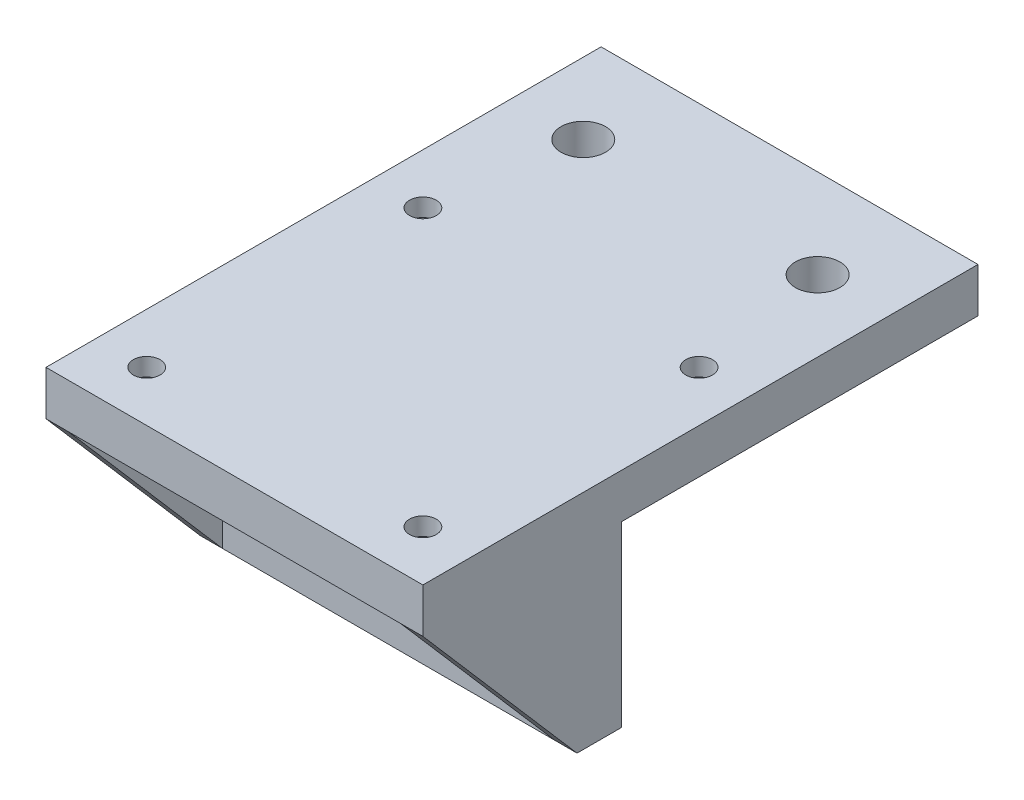
ISO-10303-21;
HEADER;
FILE_DESCRIPTION(('STEP AP214'),'2;1');
FILE_NAME('part.step','',(''),(''),'','','');
FILE_SCHEMA(('AUTOMOTIVE_DESIGN { 1 0 10303 214 1 1 1 1 }'));
ENDSEC;
DATA;
#1=APPLICATION_CONTEXT('core data for automotive mechanical design processes');
#2=APPLICATION_PROTOCOL_DEFINITION('international standard','automotive_design',2000,#1);
#3=PRODUCT_CONTEXT('',#1,'mechanical');
#4=PRODUCT('Part','Part','',(#3));
#5=PRODUCT_RELATED_PRODUCT_CATEGORY('part','',(#4));
#6=PRODUCT_DEFINITION_FORMATION('','',#4);
#7=PRODUCT_DEFINITION_CONTEXT('part definition',#1,'design');
#8=PRODUCT_DEFINITION('design','',#6,#7);
#9=PRODUCT_DEFINITION_SHAPE('','',#8);
#10=(LENGTH_UNIT() NAMED_UNIT(*) SI_UNIT(.MILLI.,.METRE.));
#11=(NAMED_UNIT(*) PLANE_ANGLE_UNIT() SI_UNIT($,.RADIAN.));
#12=(NAMED_UNIT(*) SI_UNIT($,.STERADIAN.) SOLID_ANGLE_UNIT());
#13=UNCERTAINTY_MEASURE_WITH_UNIT(LENGTH_MEASURE(1.E-05),#10,'distance_accuracy_value','');
#14=(GEOMETRIC_REPRESENTATION_CONTEXT(3) GLOBAL_UNCERTAINTY_ASSIGNED_CONTEXT((#13)) GLOBAL_UNIT_ASSIGNED_CONTEXT((#10,
#11,#12)) REPRESENTATION_CONTEXT('',''));
#15=CARTESIAN_POINT('',(0.,0.,0.));
#16=DIRECTION('',(0.,0.,1.));
#17=DIRECTION('',(1.,0.,0.));
#18=AXIS2_PLACEMENT_3D('',#15,#16,#17);
#19=CARTESIAN_POINT('',(0.,0.,0.));
#20=DIRECTION('',(0.,-1.,0.));
#21=DIRECTION('',(0.,0.,-1.));
#22=AXIS2_PLACEMENT_3D('',#19,#20,#21);
#23=PLANE('',#22);
#24=CARTESIAN_POINT('',(15.5,0.,15.5));
#25=DIRECTION('',(0.,-1.,0.));
#26=DIRECTION('',(0.,0.,-1.));
#27=AXIS2_PLACEMENT_3D('',#24,#25,#26);
#28=CIRCLE('',#27,2.75);
#29=CARTESIAN_POINT('',(15.5,0.,12.75));
#30=VERTEX_POINT('',#29);
#31=EDGE_CURVE('E220',#30,#30,#28,.T.);
#32=ORIENTED_EDGE('',*,*,#31,.F.);
#33=EDGE_LOOP('',(#32));
#34=FACE_BOUND('',#33,.T.);
#35=CARTESIAN_POINT('',(-15.5,0.,15.5));
#36=DIRECTION('',(0.,-1.,0.));
#37=DIRECTION('',(0.,0.,-1.));
#38=AXIS2_PLACEMENT_3D('',#35,#36,#37);
#39=CIRCLE('',#38,2.75);
#40=CARTESIAN_POINT('',(-15.5,0.,12.75));
#41=VERTEX_POINT('',#40);
#42=EDGE_CURVE('E177',#41,#41,#39,.T.);
#43=ORIENTED_EDGE('',*,*,#42,.F.);
#44=EDGE_LOOP('',(#43));
#45=FACE_BOUND('',#44,.T.);
#46=DIRECTION('',(-1.,0.,0.));
#47=VECTOR('',#46,1.);
#48=CARTESIAN_POINT('',(0.,0.,3.85));
#49=LINE('',#48,#47);
#50=CARTESIAN_POINT('',(18.65,0.,3.85000000000001));
#51=VERTEX_POINT('',#50);
#52=CARTESIAN_POINT('',(-18.65,0.,3.85));
#53=VERTEX_POINT('',#52);
#54=EDGE_CURVE('E136',#51,#53,#49,.T.);
#55=ORIENTED_EDGE('',*,*,#54,.F.);
#56=DIRECTION('',(0.,0.,1.));
#57=VECTOR('',#56,1.);
#58=CARTESIAN_POINT('',(18.65,0.,0.));
#59=LINE('',#58,#57);
#60=CARTESIAN_POINT('',(18.65,0.,21.15));
#61=VERTEX_POINT('',#60);
#62=EDGE_CURVE('E121',#51,#61,#59,.T.);
#63=ORIENTED_EDGE('',*,*,#62,.T.);
#64=DIRECTION('',(1.,0.,0.));
#65=VECTOR('',#64,1.);
#66=CARTESIAN_POINT('',(-21.15,0.,21.15));
#67=LINE('',#66,#65);
#68=CARTESIAN_POINT('',(-18.65,0.,21.15));
#69=VERTEX_POINT('',#68);
#70=EDGE_CURVE('E134',#69,#61,#67,.T.);
#71=ORIENTED_EDGE('',*,*,#70,.F.);
#72=DIRECTION('',(0.,0.,-1.));
#73=VECTOR('',#72,1.);
#74=CARTESIAN_POINT('',(-18.65,0.,0.));
#75=LINE('',#74,#73);
#76=EDGE_CURVE('E285',#69,#53,#75,.T.);
#77=ORIENTED_EDGE('',*,*,#76,.T.);
#78=EDGE_LOOP('',(#55,#63,#71,#77));
#79=FACE_BOUND('',#78,.T.);
#80=ADVANCED_FACE('F34',(#34,#45,#79),#23,.T.);
#81=CARTESIAN_POINT('',(0.,-20.,3.85));
#82=DIRECTION('',(0.,0.,-1.));
#83=DIRECTION('',(-1.,0.,0.));
#84=AXIS2_PLACEMENT_3D('',#81,#82,#83);
#85=PLANE('',#84);
#86=CARTESIAN_POINT('',(13.15,-10.,3.85));
#87=DIRECTION('',(0.,0.,-1.));
#88=DIRECTION('',(-1.,0.,0.));
#89=AXIS2_PLACEMENT_3D('',#86,#87,#88);
#90=CIRCLE('',#89,2.5);
#91=CARTESIAN_POINT('',(15.65,-10.,3.85));
#92=VERTEX_POINT('',#91);
#93=EDGE_CURVE('E189',#92,#92,#90,.T.);
#94=ORIENTED_EDGE('',*,*,#93,.T.);
#95=EDGE_LOOP('',(#94));
#96=FACE_BOUND('',#95,.T.);
#97=CARTESIAN_POINT('',(-13.15,-10.,3.85));
#98=DIRECTION('',(0.,0.,-1.));
#99=DIRECTION('',(-1.,0.,0.));
#100=AXIS2_PLACEMENT_3D('',#97,#98,#99);
#101=CIRCLE('',#100,2.5);
#102=CARTESIAN_POINT('',(-10.65,-10.,3.85));
#103=VERTEX_POINT('',#102);
#104=EDGE_CURVE('E180',#103,#103,#101,.T.);
#105=ORIENTED_EDGE('',*,*,#104,.T.);
#106=EDGE_LOOP('',(#105));
#107=FACE_BOUND('',#106,.T.);
#108=DIRECTION('',(0.,-1.,0.));
#109=VECTOR('',#108,1.);
#110=CARTESIAN_POINT('',(18.65,-20.,3.85000000000001));
#111=LINE('',#110,#109);
#112=CARTESIAN_POINT('',(18.65,-20.,3.85000000000001));
#113=VERTEX_POINT('',#112);
#114=EDGE_CURVE('E127',#51,#113,#111,.T.);
#115=ORIENTED_EDGE('',*,*,#114,.F.);
#116=ORIENTED_EDGE('',*,*,#54,.T.);
#117=DIRECTION('',(0.,1.,0.));
#118=VECTOR('',#117,1.);
#119=CARTESIAN_POINT('',(-18.65,-20.,3.85));
#120=LINE('',#119,#118);
#121=CARTESIAN_POINT('',(-18.65,-20.,3.85));
#122=VERTEX_POINT('',#121);
#123=EDGE_CURVE('E274',#122,#53,#120,.T.);
#124=ORIENTED_EDGE('',*,*,#123,.F.);
#125=DIRECTION('',(-1.,0.,0.));
#126=VECTOR('',#125,1.);
#127=CARTESIAN_POINT('',(0.,-20.,3.85));
#128=LINE('',#127,#126);
#129=EDGE_CURVE('E201',#113,#122,#128,.T.);
#130=ORIENTED_EDGE('',*,*,#129,.F.);
#131=EDGE_LOOP('',(#115,#116,#124,#130));
#132=FACE_BOUND('',#131,.T.);
#133=ADVANCED_FACE('F302',(#96,#107,#132),#85,.F.);
#134=DIRECTION('',(0.,0.,-1.));
#135=VECTOR('',#134,1.);
#136=CARTESIAN_POINT('',(21.15,0.,-21.15));
#137=LINE('',#136,#135);
#138=CARTESIAN_POINT('',(21.15,0.,-1.15));
#139=VERTEX_POINT('',#138);
#140=CARTESIAN_POINT('',(21.15,0.,-41.15));
#141=VERTEX_POINT('',#140);
#142=EDGE_CURVE('E141',#139,#141,#137,.T.);
#143=ORIENTED_EDGE('',*,*,#142,.F.);
#144=DIRECTION('',(1.,0.,0.));
#145=VECTOR('',#144,1.);
#146=CARTESIAN_POINT('',(0.,0.,-1.15));
#147=LINE('',#146,#145);
#148=CARTESIAN_POINT('',(-21.15,0.,-1.15));
#149=VERTEX_POINT('',#148);
#150=EDGE_CURVE('E59',#149,#139,#147,.T.);
#151=ORIENTED_EDGE('',*,*,#150,.F.);
#152=DIRECTION('',(0.,0.,1.));
#153=VECTOR('',#152,1.);
#154=CARTESIAN_POINT('',(-21.15,0.,-21.15));
#155=LINE('',#154,#153);
#156=CARTESIAN_POINT('',(-21.15,0.,-41.15));
#157=VERTEX_POINT('',#156);
#158=EDGE_CURVE('E152',#157,#149,#155,.T.);
#159=ORIENTED_EDGE('',*,*,#158,.F.);
#160=DIRECTION('',(-1.,0.,0.));
#161=VECTOR('',#160,1.);
#162=CARTESIAN_POINT('',(-21.15,0.,-41.15));
#163=LINE('',#162,#161);
#164=EDGE_CURVE('E150',#141,#157,#163,.T.);
#165=ORIENTED_EDGE('',*,*,#164,.F.);
#166=EDGE_LOOP('',(#143,#151,#159,#165));
#167=FACE_BOUND('',#166,.T.);
#168=CARTESIAN_POINT('',(13.15,0.,-31.15));
#169=DIRECTION('',(0.,-1.,0.));
#170=DIRECTION('',(0.,0.,-1.));
#171=AXIS2_PLACEMENT_3D('',#168,#169,#170);
#172=CIRCLE('',#171,2.5);
#173=CARTESIAN_POINT('',(13.15,0.,-33.65));
#174=VERTEX_POINT('',#173);
#175=EDGE_CURVE('E290',#174,#174,#172,.T.);
#176=ORIENTED_EDGE('',*,*,#175,.F.);
#177=EDGE_LOOP('',(#176));
#178=FACE_BOUND('',#177,.T.);
#179=CARTESIAN_POINT('',(-13.15,0.,-31.15));
#180=DIRECTION('',(0.,-1.,0.));
#181=DIRECTION('',(0.,0.,-1.));
#182=AXIS2_PLACEMENT_3D('',#179,#180,#181);
#183=CIRCLE('',#182,2.5);
#184=CARTESIAN_POINT('',(-13.15,0.,-33.65));
#185=VERTEX_POINT('',#184);
#186=EDGE_CURVE('E295',#185,#185,#183,.T.);
#187=ORIENTED_EDGE('',*,*,#186,.F.);
#188=EDGE_LOOP('',(#187));
#189=FACE_BOUND('',#188,.T.);
#190=CARTESIAN_POINT('',(15.5,0.,-15.5));
#191=DIRECTION('',(0.,-1.,0.));
#192=DIRECTION('',(0.,0.,-1.));
#193=AXIS2_PLACEMENT_3D('',#190,#191,#192);
#194=CIRCLE('',#193,2.75);
#195=CARTESIAN_POINT('',(15.5,0.,-18.25));
#196=VERTEX_POINT('',#195);
#197=EDGE_CURVE('E211',#196,#196,#194,.T.);
#198=ORIENTED_EDGE('',*,*,#197,.F.);
#199=EDGE_LOOP('',(#198));
#200=FACE_BOUND('',#199,.T.);
#201=CARTESIAN_POINT('',(-15.5,0.,-15.5));
#202=DIRECTION('',(0.,-1.,0.));
#203=DIRECTION('',(0.,0.,-1.));
#204=AXIS2_PLACEMENT_3D('',#201,#202,#203);
#205=CIRCLE('',#204,2.75);
#206=CARTESIAN_POINT('',(-15.5,0.,-18.25));
#207=VERTEX_POINT('',#206);
#208=EDGE_CURVE('E214',#207,#207,#205,.T.);
#209=ORIENTED_EDGE('',*,*,#208,.F.);
#210=EDGE_LOOP('',(#209));
#211=FACE_BOUND('',#210,.T.);
#212=ADVANCED_FACE('F260',(#167,#178,#189,#200,#211),#23,.T.);
#213=CARTESIAN_POINT('',(-15.5,5.,-15.5));
#214=DIRECTION('',(0.,-1.,0.));
#215=DIRECTION('',(0.,0.,-1.));
#216=AXIS2_PLACEMENT_3D('',#213,#214,#215);
#217=CYLINDRICAL_SURFACE('',#216,1.5);
#218=CARTESIAN_POINT('',(-15.5,5.,-15.5));
#219=DIRECTION('',(0.,1.,0.));
#220=DIRECTION('',(0.,0.,1.));
#221=AXIS2_PLACEMENT_3D('',#218,#219,#220);
#222=CIRCLE('',#221,1.5);
#223=CARTESIAN_POINT('',(-15.5,5.,-14.));
#224=VERTEX_POINT('',#223);
#225=EDGE_CURVE('E139',#224,#224,#222,.T.);
#226=ORIENTED_EDGE('',*,*,#225,.T.);
#227=EDGE_LOOP('',(#226));
#228=FACE_BOUND('',#227,.T.);
#229=CARTESIAN_POINT('',(-15.5,3.,-15.5));
#230=DIRECTION('',(0.,-1.,0.));
#231=DIRECTION('',(0.,0.,-1.));
#232=AXIS2_PLACEMENT_3D('',#229,#230,#231);
#233=CIRCLE('',#232,1.5);
#234=CARTESIAN_POINT('',(-15.5,3.,-17.));
#235=VERTEX_POINT('',#234);
#236=EDGE_CURVE('E175',#235,#235,#233,.T.);
#237=ORIENTED_EDGE('',*,*,#236,.T.);
#238=EDGE_LOOP('',(#237));
#239=FACE_BOUND('',#238,.T.);
#240=ADVANCED_FACE('F335',(#228,#239),#217,.F.);
#241=CARTESIAN_POINT('',(15.5,5.,-15.5));
#242=DIRECTION('',(0.,-1.,0.));
#243=DIRECTION('',(0.,0.,-1.));
#244=AXIS2_PLACEMENT_3D('',#241,#242,#243);
#245=CYLINDRICAL_SURFACE('',#244,1.5);
#246=CARTESIAN_POINT('',(15.5,5.,-15.5));
#247=DIRECTION('',(0.,1.,0.));
#248=DIRECTION('',(0.,0.,1.));
#249=AXIS2_PLACEMENT_3D('',#246,#247,#248);
#250=CIRCLE('',#249,1.5);
#251=CARTESIAN_POINT('',(15.5,5.,-14.));
#252=VERTEX_POINT('',#251);
#253=EDGE_CURVE('E143',#252,#252,#250,.T.);
#254=ORIENTED_EDGE('',*,*,#253,.T.);
#255=EDGE_LOOP('',(#254));
#256=FACE_BOUND('',#255,.T.);
#257=CARTESIAN_POINT('',(15.5,3.,-15.5));
#258=DIRECTION('',(0.,-1.,0.));
#259=DIRECTION('',(0.,0.,-1.));
#260=AXIS2_PLACEMENT_3D('',#257,#258,#259);
#261=CIRCLE('',#260,1.5);
#262=CARTESIAN_POINT('',(15.5,3.,-17.));
#263=VERTEX_POINT('',#262);
#264=EDGE_CURVE('E171',#263,#263,#261,.T.);
#265=ORIENTED_EDGE('',*,*,#264,.T.);
#266=EDGE_LOOP('',(#265));
#267=FACE_BOUND('',#266,.T.);
#268=ADVANCED_FACE('F339',(#256,#267),#245,.F.);
#269=CARTESIAN_POINT('',(15.5,5.,15.5));
#270=DIRECTION('',(0.,-1.,0.));
#271=DIRECTION('',(0.,0.,-1.));
#272=AXIS2_PLACEMENT_3D('',#269,#270,#271);
#273=CYLINDRICAL_SURFACE('',#272,1.5);
#274=CARTESIAN_POINT('',(15.5,5.,15.5));
#275=DIRECTION('',(0.,1.,0.));
#276=DIRECTION('',(0.,0.,1.));
#277=AXIS2_PLACEMENT_3D('',#274,#275,#276);
#278=CIRCLE('',#277,1.5);
#279=CARTESIAN_POINT('',(15.5,5.,17.));
#280=VERTEX_POINT('',#279);
#281=EDGE_CURVE('E166',#280,#280,#278,.T.);
#282=ORIENTED_EDGE('',*,*,#281,.T.);
#283=EDGE_LOOP('',(#282));
#284=FACE_BOUND('',#283,.T.);
#285=CARTESIAN_POINT('',(15.5,3.,15.5));
#286=DIRECTION('',(0.,-1.,0.));
#287=DIRECTION('',(0.,0.,-1.));
#288=AXIS2_PLACEMENT_3D('',#285,#286,#287);
#289=CIRCLE('',#288,1.5);
#290=CARTESIAN_POINT('',(15.5,3.,14.));
#291=VERTEX_POINT('',#290);
#292=EDGE_CURVE('E168',#291,#291,#289,.T.);
#293=ORIENTED_EDGE('',*,*,#292,.T.);
#294=EDGE_LOOP('',(#293));
#295=FACE_BOUND('',#294,.T.);
#296=ADVANCED_FACE('F345',(#284,#295),#273,.F.);
#297=CARTESIAN_POINT('',(-15.5,5.,15.5));
#298=DIRECTION('',(0.,-1.,0.));
#299=DIRECTION('',(0.,0.,-1.));
#300=AXIS2_PLACEMENT_3D('',#297,#298,#299);
#301=CYLINDRICAL_SURFACE('',#300,1.5);
#302=CARTESIAN_POINT('',(-15.5,5.,15.5));
#303=DIRECTION('',(0.,1.,0.));
#304=DIRECTION('',(0.,0.,1.));
#305=AXIS2_PLACEMENT_3D('',#302,#303,#304);
#306=CIRCLE('',#305,1.5);
#307=CARTESIAN_POINT('',(-15.5,5.,17.));
#308=VERTEX_POINT('',#307);
#309=EDGE_CURVE('E234',#308,#308,#306,.T.);
#310=ORIENTED_EDGE('',*,*,#309,.T.);
#311=EDGE_LOOP('',(#310));
#312=FACE_BOUND('',#311,.T.);
#313=CARTESIAN_POINT('',(-15.5,3.,15.5));
#314=DIRECTION('',(0.,-1.,0.));
#315=DIRECTION('',(0.,0.,-1.));
#316=AXIS2_PLACEMENT_3D('',#313,#314,#315);
#317=CIRCLE('',#316,1.5);
#318=CARTESIAN_POINT('',(-15.5,3.,14.));
#319=VERTEX_POINT('',#318);
#320=EDGE_CURVE('E163',#319,#319,#317,.T.);
#321=ORIENTED_EDGE('',*,*,#320,.T.);
#322=EDGE_LOOP('',(#321));
#323=FACE_BOUND('',#322,.T.);
#324=ADVANCED_FACE('F351',(#312,#323),#301,.F.);
#325=CARTESIAN_POINT('',(0.,5.,0.));
#326=DIRECTION('',(0.,-1.,0.));
#327=DIRECTION('',(0.,0.,-1.));
#328=AXIS2_PLACEMENT_3D('',#325,#326,#327);
#329=PLANE('',#328);
#330=DIRECTION('',(-1.,0.,0.));
#331=VECTOR('',#330,1.);
#332=CARTESIAN_POINT('',(-21.15,5.,-41.15));
#333=LINE('',#332,#331);
#334=CARTESIAN_POINT('',(21.15,5.,-41.15));
#335=VERTEX_POINT('',#334);
#336=CARTESIAN_POINT('',(-21.15,5.,-41.15));
#337=VERTEX_POINT('',#336);
#338=EDGE_CURVE('E147',#335,#337,#333,.T.);
#339=ORIENTED_EDGE('',*,*,#338,.T.);
#340=DIRECTION('',(0.,0.,1.));
#341=VECTOR('',#340,1.);
#342=CARTESIAN_POINT('',(-21.15,5.,21.15));
#343=LINE('',#342,#341);
#344=CARTESIAN_POINT('',(-21.15,5.,21.15));
#345=VERTEX_POINT('',#344);
#346=EDGE_CURVE('E155',#337,#345,#343,.T.);
#347=ORIENTED_EDGE('',*,*,#346,.T.);
#348=DIRECTION('',(1.,0.,0.));
#349=VECTOR('',#348,1.);
#350=CARTESIAN_POINT('',(-21.15,5.,21.15));
#351=LINE('',#350,#349);
#352=CARTESIAN_POINT('',(21.15,5.,21.15));
#353=VERTEX_POINT('',#352);
#354=EDGE_CURVE('E241',#345,#353,#351,.T.);
#355=ORIENTED_EDGE('',*,*,#354,.T.);
#356=DIRECTION('',(0.,0.,-1.));
#357=VECTOR('',#356,1.);
#358=CARTESIAN_POINT('',(21.15,5.,21.15));
#359=LINE('',#358,#357);
#360=EDGE_CURVE('E242',#353,#335,#359,.T.);
#361=ORIENTED_EDGE('',*,*,#360,.T.);
#362=EDGE_LOOP('',(#339,#347,#355,#361));
#363=FACE_BOUND('',#362,.T.);
#364=CARTESIAN_POINT('',(13.15,5.,-31.15));
#365=DIRECTION('',(0.,1.,0.));
#366=DIRECTION('',(0.,0.,1.));
#367=AXIS2_PLACEMENT_3D('',#364,#365,#366);
#368=CIRCLE('',#367,2.5);
#369=CARTESIAN_POINT('',(13.15,5.,-28.65));
#370=VERTEX_POINT('',#369);
#371=EDGE_CURVE('E287',#370,#370,#368,.T.);
#372=ORIENTED_EDGE('',*,*,#371,.F.);
#373=EDGE_LOOP('',(#372));
#374=FACE_BOUND('',#373,.T.);
#375=CARTESIAN_POINT('',(-13.15,5.,-31.15));
#376=DIRECTION('',(0.,1.,0.));
#377=DIRECTION('',(0.,0.,1.));
#378=AXIS2_PLACEMENT_3D('',#375,#376,#377);
#379=CIRCLE('',#378,2.5);
#380=CARTESIAN_POINT('',(-13.15,5.,-28.65));
#381=VERTEX_POINT('',#380);
#382=EDGE_CURVE('E293',#381,#381,#379,.T.);
#383=ORIENTED_EDGE('',*,*,#382,.F.);
#384=EDGE_LOOP('',(#383));
#385=FACE_BOUND('',#384,.T.);
#386=ORIENTED_EDGE('',*,*,#225,.F.);
#387=EDGE_LOOP('',(#386));
#388=FACE_BOUND('',#387,.T.);
#389=ORIENTED_EDGE('',*,*,#253,.F.);
#390=EDGE_LOOP('',(#389));
#391=FACE_BOUND('',#390,.T.);
#392=ORIENTED_EDGE('',*,*,#309,.F.);
#393=EDGE_LOOP('',(#392));
#394=FACE_BOUND('',#393,.T.);
#395=ORIENTED_EDGE('',*,*,#281,.F.);
#396=EDGE_LOOP('',(#395));
#397=FACE_BOUND('',#396,.T.);
#398=ADVANCED_FACE('F248',(#363,#374,#385,#388,#391,#394,#397),#329,.F.);
#399=CARTESIAN_POINT('',(-21.15,5.,21.15));
#400=DIRECTION('',(0.,0.,-1.));
#401=DIRECTION('',(-1.,0.,0.));
#402=AXIS2_PLACEMENT_3D('',#399,#400,#401);
#403=PLANE('',#402);
#404=DIRECTION('',(0.,-1.,0.));
#405=VECTOR('',#404,1.);
#406=CARTESIAN_POINT('',(21.15,5.,21.15));
#407=LINE('',#406,#405);
#408=CARTESIAN_POINT('',(21.15,0.,21.15));
#409=VERTEX_POINT('',#408);
#410=EDGE_CURVE('E43',#353,#409,#407,.T.);
#411=ORIENTED_EDGE('',*,*,#410,.F.);
#412=ORIENTED_EDGE('',*,*,#354,.F.);
#413=DIRECTION('',(0.,-1.,0.));
#414=VECTOR('',#413,1.);
#415=CARTESIAN_POINT('',(-21.15,5.,21.15));
#416=LINE('',#415,#414);
#417=CARTESIAN_POINT('',(-21.15,0.,21.15));
#418=VERTEX_POINT('',#417);
#419=EDGE_CURVE('E11',#345,#418,#416,.T.);
#420=ORIENTED_EDGE('',*,*,#419,.T.);
#421=EDGE_CURVE('E138',#418,#69,#67,.T.);
#422=ORIENTED_EDGE('',*,*,#421,.T.);
#423=ORIENTED_EDGE('',*,*,#70,.T.);
#424=DIRECTION('',(1.,0.,0.));
#425=VECTOR('',#424,1.);
#426=CARTESIAN_POINT('',(-21.15,0.,21.15));
#427=LINE('',#426,#425);
#428=EDGE_CURVE('E112',#409,#61,#427,.F.);
#429=ORIENTED_EDGE('',*,*,#428,.F.);
#430=EDGE_LOOP('',(#411,#412,#420,#422,#423,#429));
#431=FACE_BOUND('',#430,.T.);
#432=ADVANCED_FACE('F36',(#431),#403,.F.);
#433=CARTESIAN_POINT('',(21.15,5.,-21.15));
#434=DIRECTION('',(-1.,0.,0.));
#435=DIRECTION('',(0.,0.,1.));
#436=AXIS2_PLACEMENT_3D('',#433,#434,#435);
#437=PLANE('',#436);
#438=ORIENTED_EDGE('',*,*,#410,.T.);
#439=DIRECTION('',(0.,0.756312601861097,0.654210400609848));
#440=VECTOR('',#439,1.);
#441=CARTESIAN_POINT('',(21.15,-20.,3.85));
#442=LINE('',#441,#440);
#443=CARTESIAN_POINT('',(21.15,-20.,3.85));
#444=VERTEX_POINT('',#443);
#445=EDGE_CURVE('E115',#444,#409,#442,.T.);
#446=ORIENTED_EDGE('',*,*,#445,.F.);
#447=DIRECTION('',(0.,0.,1.));
#448=VECTOR('',#447,1.);
#449=CARTESIAN_POINT('',(21.15,-20.,0.));
#450=LINE('',#449,#448);
#451=CARTESIAN_POINT('',(21.15,-20.,-1.15));
#452=VERTEX_POINT('',#451);
#453=EDGE_CURVE('E193',#452,#444,#450,.T.);
#454=ORIENTED_EDGE('',*,*,#453,.F.);
#455=DIRECTION('',(0.,1.,0.));
#456=VECTOR('',#455,1.);
#457=CARTESIAN_POINT('',(21.15,-20.,-1.15));
#458=LINE('',#457,#456);
#459=EDGE_CURVE('E204',#452,#139,#458,.T.);
#460=ORIENTED_EDGE('',*,*,#459,.T.);
#461=ORIENTED_EDGE('',*,*,#142,.T.);
#462=DIRECTION('',(0.,-1.,0.));
#463=VECTOR('',#462,1.);
#464=CARTESIAN_POINT('',(21.15,5.,-41.15));
#465=LINE('',#464,#463);
#466=EDGE_CURVE('E159',#335,#141,#465,.T.);
#467=ORIENTED_EDGE('',*,*,#466,.F.);
#468=ORIENTED_EDGE('',*,*,#360,.F.);
#469=EDGE_LOOP('',(#438,#446,#454,#460,#461,#467,#468));
#470=FACE_BOUND('',#469,.T.);
#471=ADVANCED_FACE('F277',(#470),#437,.F.);
#472=CARTESIAN_POINT('',(-21.15,5.,-41.15));
#473=DIRECTION('',(0.,0.,1.));
#474=DIRECTION('',(1.,0.,0.));
#475=AXIS2_PLACEMENT_3D('',#472,#473,#474);
#476=PLANE('',#475);
#477=ORIENTED_EDGE('',*,*,#164,.T.);
#478=DIRECTION('',(0.,-1.,0.));
#479=VECTOR('',#478,1.);
#480=CARTESIAN_POINT('',(-21.15,5.,-41.15));
#481=LINE('',#480,#479);
#482=EDGE_CURVE('E156',#337,#157,#481,.T.);
#483=ORIENTED_EDGE('',*,*,#482,.F.);
#484=ORIENTED_EDGE('',*,*,#338,.F.);
#485=ORIENTED_EDGE('',*,*,#466,.T.);
#486=EDGE_LOOP('',(#477,#483,#484,#485));
#487=FACE_BOUND('',#486,.T.);
#488=ADVANCED_FACE('F257',(#487),#476,.F.);
#489=CARTESIAN_POINT('',(-21.15,5.,-21.15));
#490=DIRECTION('',(1.,0.,0.));
#491=DIRECTION('',(0.,0.,-1.));
#492=AXIS2_PLACEMENT_3D('',#489,#490,#491);
#493=PLANE('',#492);
#494=DIRECTION('',(0.,0.756312601861097,0.654210400609848));
#495=VECTOR('',#494,1.);
#496=CARTESIAN_POINT('',(-21.15,-20.,3.85));
#497=LINE('',#496,#495);
#498=CARTESIAN_POINT('',(-21.15,-20.,3.85));
#499=VERTEX_POINT('',#498);
#500=EDGE_CURVE('E272',#499,#418,#497,.T.);
#501=ORIENTED_EDGE('',*,*,#500,.T.);
#502=ORIENTED_EDGE('',*,*,#419,.F.);
#503=ORIENTED_EDGE('',*,*,#346,.F.);
#504=ORIENTED_EDGE('',*,*,#482,.T.);
#505=ORIENTED_EDGE('',*,*,#158,.T.);
#506=DIRECTION('',(0.,1.,0.));
#507=VECTOR('',#506,1.);
#508=CARTESIAN_POINT('',(-21.15,-20.,-1.15));
#509=LINE('',#508,#507);
#510=CARTESIAN_POINT('',(-21.15,-20.,-1.15));
#511=VERTEX_POINT('',#510);
#512=EDGE_CURVE('E209',#511,#149,#509,.T.);
#513=ORIENTED_EDGE('',*,*,#512,.F.);
#514=DIRECTION('',(0.,0.,-1.));
#515=VECTOR('',#514,1.);
#516=CARTESIAN_POINT('',(-21.15,-20.,0.));
#517=LINE('',#516,#515);
#518=EDGE_CURVE('E200',#499,#511,#517,.T.);
#519=ORIENTED_EDGE('',*,*,#518,.F.);
#520=EDGE_LOOP('',(#501,#502,#503,#504,#505,#513,#519));
#521=FACE_BOUND('',#520,.T.);
#522=ADVANCED_FACE('F255',(#521),#493,.F.);
#523=CARTESIAN_POINT('',(-15.5,3.,15.5));
#524=DIRECTION('',(0.,-1.,0.));
#525=DIRECTION('',(0.,0.,-1.));
#526=AXIS2_PLACEMENT_3D('',#523,#524,#525);
#527=CYLINDRICAL_SURFACE('',#526,2.75);
#528=CARTESIAN_POINT('',(-15.5,3.,15.5));
#529=DIRECTION('',(0.,-1.,0.));
#530=DIRECTION('',(0.,0.,-1.));
#531=AXIS2_PLACEMENT_3D('',#528,#529,#530);
#532=CIRCLE('',#531,2.75);
#533=CARTESIAN_POINT('',(-15.5,3.,12.75));
#534=VERTEX_POINT('',#533);
#535=EDGE_CURVE('E167',#534,#534,#532,.T.);
#536=ORIENTED_EDGE('',*,*,#535,.F.);
#537=EDGE_LOOP('',(#536));
#538=FACE_BOUND('',#537,.T.);
#539=ORIENTED_EDGE('',*,*,#42,.T.);
#540=EDGE_LOOP('',(#539));
#541=FACE_BOUND('',#540,.T.);
#542=ADVANCED_FACE('F364',(#538,#541),#527,.F.);
#543=CARTESIAN_POINT('',(-15.5,3.,15.5));
#544=DIRECTION('',(0.,-1.,0.));
#545=DIRECTION('',(0.,0.,-1.));
#546=AXIS2_PLACEMENT_3D('',#543,#544,#545);
#547=PLANE('',#546);
#548=ORIENTED_EDGE('',*,*,#320,.F.);
#549=EDGE_LOOP('',(#548));
#550=FACE_BOUND('',#549,.T.);
#551=ORIENTED_EDGE('',*,*,#535,.T.);
#552=EDGE_LOOP('',(#551));
#553=FACE_BOUND('',#552,.T.);
#554=ADVANCED_FACE('F367',(#550,#553),#547,.T.);
#555=CARTESIAN_POINT('',(15.5,3.,15.5));
#556=DIRECTION('',(0.,-1.,0.));
#557=DIRECTION('',(0.,0.,-1.));
#558=AXIS2_PLACEMENT_3D('',#555,#556,#557);
#559=CYLINDRICAL_SURFACE('',#558,2.75);
#560=CARTESIAN_POINT('',(15.5,3.,15.5));
#561=DIRECTION('',(0.,-1.,0.));
#562=DIRECTION('',(0.,0.,-1.));
#563=AXIS2_PLACEMENT_3D('',#560,#561,#562);
#564=CIRCLE('',#563,2.75);
#565=CARTESIAN_POINT('',(15.5,3.,12.75));
#566=VERTEX_POINT('',#565);
#567=EDGE_CURVE('E217',#566,#566,#564,.T.);
#568=ORIENTED_EDGE('',*,*,#567,.F.);
#569=EDGE_LOOP('',(#568));
#570=FACE_BOUND('',#569,.T.);
#571=ORIENTED_EDGE('',*,*,#31,.T.);
#572=EDGE_LOOP('',(#571));
#573=FACE_BOUND('',#572,.T.);
#574=ADVANCED_FACE('F371',(#570,#573),#559,.F.);
#575=CARTESIAN_POINT('',(15.5,3.,15.5));
#576=DIRECTION('',(0.,-1.,0.));
#577=DIRECTION('',(0.,0.,-1.));
#578=AXIS2_PLACEMENT_3D('',#575,#576,#577);
#579=PLANE('',#578);
#580=ORIENTED_EDGE('',*,*,#292,.F.);
#581=EDGE_LOOP('',(#580));
#582=FACE_BOUND('',#581,.T.);
#583=ORIENTED_EDGE('',*,*,#567,.T.);
#584=EDGE_LOOP('',(#583));
#585=FACE_BOUND('',#584,.T.);
#586=ADVANCED_FACE('F377',(#582,#585),#579,.T.);
#587=CARTESIAN_POINT('',(15.5,3.,-15.5));
#588=DIRECTION('',(0.,-1.,0.));
#589=DIRECTION('',(0.,0.,-1.));
#590=AXIS2_PLACEMENT_3D('',#587,#588,#589);
#591=CYLINDRICAL_SURFACE('',#590,2.75);
#592=CARTESIAN_POINT('',(15.5,3.,-15.5));
#593=DIRECTION('',(0.,-1.,0.));
#594=DIRECTION('',(0.,0.,-1.));
#595=AXIS2_PLACEMENT_3D('',#592,#593,#594);
#596=CIRCLE('',#595,2.75);
#597=CARTESIAN_POINT('',(15.5,3.,-18.25));
#598=VERTEX_POINT('',#597);
#599=EDGE_CURVE('E223',#598,#598,#596,.T.);
#600=ORIENTED_EDGE('',*,*,#599,.F.);
#601=EDGE_LOOP('',(#600));
#602=FACE_BOUND('',#601,.T.);
#603=ORIENTED_EDGE('',*,*,#197,.T.);
#604=EDGE_LOOP('',(#603));
#605=FACE_BOUND('',#604,.T.);
#606=ADVANCED_FACE('F373',(#602,#605),#591,.F.);
#607=CARTESIAN_POINT('',(15.5,3.,-15.5));
#608=DIRECTION('',(0.,-1.,0.));
#609=DIRECTION('',(0.,0.,-1.));
#610=AXIS2_PLACEMENT_3D('',#607,#608,#609);
#611=PLANE('',#610);
#612=ORIENTED_EDGE('',*,*,#264,.F.);
#613=EDGE_LOOP('',(#612));
#614=FACE_BOUND('',#613,.T.);
#615=ORIENTED_EDGE('',*,*,#599,.T.);
#616=EDGE_LOOP('',(#615));
#617=FACE_BOUND('',#616,.T.);
#618=ADVANCED_FACE('F376',(#614,#617),#611,.T.);
#619=CARTESIAN_POINT('',(-15.5,3.,-15.5));
#620=DIRECTION('',(0.,-1.,0.));
#621=DIRECTION('',(0.,0.,-1.));
#622=AXIS2_PLACEMENT_3D('',#619,#620,#621);
#623=CYLINDRICAL_SURFACE('',#622,2.75);
#624=CARTESIAN_POINT('',(-15.5,3.,-15.5));
#625=DIRECTION('',(0.,-1.,0.));
#626=DIRECTION('',(0.,0.,-1.));
#627=AXIS2_PLACEMENT_3D('',#624,#625,#626);
#628=CIRCLE('',#627,2.75);
#629=CARTESIAN_POINT('',(-15.5,3.,-18.25));
#630=VERTEX_POINT('',#629);
#631=EDGE_CURVE('E172',#630,#630,#628,.T.);
#632=ORIENTED_EDGE('',*,*,#631,.F.);
#633=EDGE_LOOP('',(#632));
#634=FACE_BOUND('',#633,.T.);
#635=ORIENTED_EDGE('',*,*,#208,.T.);
#636=EDGE_LOOP('',(#635));
#637=FACE_BOUND('',#636,.T.);
#638=ADVANCED_FACE('F320',(#634,#637),#623,.F.);
#639=CARTESIAN_POINT('',(-15.5,3.,-15.5));
#640=DIRECTION('',(0.,-1.,0.));
#641=DIRECTION('',(0.,0.,-1.));
#642=AXIS2_PLACEMENT_3D('',#639,#640,#641);
#643=PLANE('',#642);
#644=ORIENTED_EDGE('',*,*,#236,.F.);
#645=EDGE_LOOP('',(#644));
#646=FACE_BOUND('',#645,.T.);
#647=ORIENTED_EDGE('',*,*,#631,.T.);
#648=EDGE_LOOP('',(#647));
#649=FACE_BOUND('',#648,.T.);
#650=ADVANCED_FACE('F313',(#646,#649),#643,.T.);
#651=CARTESIAN_POINT('',(0.,-20.,-1.15));
#652=DIRECTION('',(0.,0.,1.));
#653=DIRECTION('',(1.,0.,0.));
#654=AXIS2_PLACEMENT_3D('',#651,#652,#653);
#655=PLANE('',#654);
#656=ORIENTED_EDGE('',*,*,#459,.F.);
#657=DIRECTION('',(1.,0.,0.));
#658=VECTOR('',#657,1.);
#659=CARTESIAN_POINT('',(0.,-20.,-1.15));
#660=LINE('',#659,#658);
#661=EDGE_CURVE('E203',#511,#452,#660,.T.);
#662=ORIENTED_EDGE('',*,*,#661,.F.);
#663=ORIENTED_EDGE('',*,*,#512,.T.);
#664=ORIENTED_EDGE('',*,*,#150,.T.);
#665=EDGE_LOOP('',(#656,#662,#663,#664));
#666=FACE_BOUND('',#665,.T.);
#667=CARTESIAN_POINT('',(13.15,-10.,-1.15));
#668=DIRECTION('',(0.,0.,1.));
#669=DIRECTION('',(1.,0.,0.));
#670=AXIS2_PLACEMENT_3D('',#667,#668,#669);
#671=CIRCLE('',#670,2.5);
#672=CARTESIAN_POINT('',(15.65,-10.,-1.14999999999999));
#673=VERTEX_POINT('',#672);
#674=EDGE_CURVE('E38',#673,#673,#671,.F.);
#675=ORIENTED_EDGE('',*,*,#674,.F.);
#676=EDGE_LOOP('',(#675));
#677=FACE_BOUND('',#676,.T.);
#678=CARTESIAN_POINT('',(-13.15,-10.,-1.15));
#679=DIRECTION('',(0.,0.,1.));
#680=DIRECTION('',(1.,0.,0.));
#681=AXIS2_PLACEMENT_3D('',#678,#679,#680);
#682=CIRCLE('',#681,2.5);
#683=CARTESIAN_POINT('',(-10.65,-10.,-1.14999999999999));
#684=VERTEX_POINT('',#683);
#685=EDGE_CURVE('E178',#684,#684,#682,.F.);
#686=ORIENTED_EDGE('',*,*,#685,.F.);
#687=EDGE_LOOP('',(#686));
#688=FACE_BOUND('',#687,.T.);
#689=ADVANCED_FACE('F265',(#666,#677,#688),#655,.F.);
#690=CARTESIAN_POINT('',(0.,-20.,0.));
#691=DIRECTION('',(0.,-1.,0.));
#692=DIRECTION('',(0.,0.,-1.));
#693=AXIS2_PLACEMENT_3D('',#690,#691,#692);
#694=PLANE('',#693);
#695=EDGE_CURVE('E197',#444,#113,#128,.T.);
#696=ORIENTED_EDGE('',*,*,#695,.T.);
#697=ORIENTED_EDGE('',*,*,#129,.T.);
#698=EDGE_CURVE('E196',#122,#499,#128,.T.);
#699=ORIENTED_EDGE('',*,*,#698,.T.);
#700=ORIENTED_EDGE('',*,*,#518,.T.);
#701=ORIENTED_EDGE('',*,*,#661,.T.);
#702=ORIENTED_EDGE('',*,*,#453,.T.);
#703=EDGE_LOOP('',(#696,#697,#699,#700,#701,#702));
#704=FACE_BOUND('',#703,.T.);
#705=ADVANCED_FACE('F269',(#704),#694,.T.);
#706=CARTESIAN_POINT('',(-13.15,-10.,-41.15));
#707=DIRECTION('',(0.,0.,1.));
#708=DIRECTION('',(1.,0.,0.));
#709=AXIS2_PLACEMENT_3D('',#706,#707,#708);
#710=CYLINDRICAL_SURFACE('',#709,2.5);
#711=CARTESIAN_POINT('',(-10.65,-10.,3.85));
#712=CARTESIAN_POINT('',(-10.65,-10.,3.79791666666667));
#713=CARTESIAN_POINT('',(-10.65,-10.,3.74583333333333));
#714=CARTESIAN_POINT('',(-10.65,-10.,3.64166666666667));
#715=CARTESIAN_POINT('',(-10.65,-10.,3.58958333333333));
#716=CARTESIAN_POINT('',(-10.65,-10.,3.48541666666667));
#717=CARTESIAN_POINT('',(-10.65,-10.,3.43333333333333));
#718=CARTESIAN_POINT('',(-10.65,-10.,3.32916666666667));
#719=CARTESIAN_POINT('',(-10.65,-10.,3.27708333333333));
#720=CARTESIAN_POINT('',(-10.65,-10.,3.17291666666667));
#721=CARTESIAN_POINT('',(-10.65,-10.,3.12083333333333));
#722=CARTESIAN_POINT('',(-10.65,-10.,3.01666666666667));
#723=CARTESIAN_POINT('',(-10.65,-10.,2.96458333333333));
#724=CARTESIAN_POINT('',(-10.65,-10.,2.86041666666667));
#725=CARTESIAN_POINT('',(-10.65,-10.,2.80833333333333));
#726=CARTESIAN_POINT('',(-10.65,-10.,2.70416666666667));
#727=CARTESIAN_POINT('',(-10.65,-10.,2.65208333333333));
#728=CARTESIAN_POINT('',(-10.65,-10.,2.54791666666667));
#729=CARTESIAN_POINT('',(-10.65,-10.,2.49583333333333));
#730=CARTESIAN_POINT('',(-10.65,-10.,2.39166666666667));
#731=CARTESIAN_POINT('',(-10.65,-10.,2.33958333333334));
#732=CARTESIAN_POINT('',(-10.65,-10.,2.23541666666667));
#733=CARTESIAN_POINT('',(-10.65,-10.,2.18333333333334));
#734=CARTESIAN_POINT('',(-10.65,-10.,2.07916666666667));
#735=CARTESIAN_POINT('',(-10.65,-10.,2.02708333333334));
#736=CARTESIAN_POINT('',(-10.65,-10.,1.92291666666667));
#737=CARTESIAN_POINT('',(-10.65,-10.,1.87083333333334));
#738=CARTESIAN_POINT('',(-10.65,-10.,1.76666666666667));
#739=CARTESIAN_POINT('',(-10.65,-10.,1.71458333333334));
#740=CARTESIAN_POINT('',(-10.65,-10.,1.61041666666667));
#741=CARTESIAN_POINT('',(-10.65,-10.,1.55833333333334));
#742=CARTESIAN_POINT('',(-10.65,-10.,1.45416666666667));
#743=CARTESIAN_POINT('',(-10.65,-10.,1.40208333333334));
#744=CARTESIAN_POINT('',(-10.65,-10.,1.29791666666667));
#745=CARTESIAN_POINT('',(-10.65,-10.,1.24583333333334));
#746=CARTESIAN_POINT('',(-10.65,-10.,1.14166666666667));
#747=CARTESIAN_POINT('',(-10.65,-10.,1.08958333333334));
#748=CARTESIAN_POINT('',(-10.65,-10.,0.985416666666671));
#749=CARTESIAN_POINT('',(-10.65,-10.,0.933333333333339));
#750=CARTESIAN_POINT('',(-10.65,-10.,0.829166666666672));
#751=CARTESIAN_POINT('',(-10.65,-10.,0.777083333333338));
#752=CARTESIAN_POINT('',(-10.65,-10.,0.672916666666671));
#753=CARTESIAN_POINT('',(-10.65,-10.,0.620833333333339));
#754=CARTESIAN_POINT('',(-10.65,-10.,0.516666666666672));
#755=CARTESIAN_POINT('',(-10.65,-10.,0.464583333333338));
#756=CARTESIAN_POINT('',(-10.65,-10.,0.360416666666671));
#757=CARTESIAN_POINT('',(-10.65,-10.,0.308333333333339));
#758=CARTESIAN_POINT('',(-10.65,-10.,0.204166666666674));
#759=CARTESIAN_POINT('',(-10.65,-10.,0.152083333333342));
#760=CARTESIAN_POINT('',(-10.65,-10.,0.0479166666666753));
#761=CARTESIAN_POINT('',(-10.65,-10.,-0.00416666666665928));
#762=CARTESIAN_POINT('',(-10.65,-10.,-0.108333333333326));
#763=CARTESIAN_POINT('',(-10.65,-10.,-0.160416666666658));
#764=CARTESIAN_POINT('',(-10.65,-10.,-0.264583333333325));
#765=CARTESIAN_POINT('',(-10.65,-10.,-0.31666666666666));
#766=CARTESIAN_POINT('',(-10.65,-10.,-0.420833333333326));
#767=CARTESIAN_POINT('',(-10.65,-10.,-0.472916666666659));
#768=CARTESIAN_POINT('',(-10.65,-10.,-0.577083333333325));
#769=CARTESIAN_POINT('',(-10.65,-10.,-0.62916666666666));
#770=CARTESIAN_POINT('',(-10.65,-10.,-0.733333333333327));
#771=CARTESIAN_POINT('',(-10.65,-10.,-0.785416666666659));
#772=CARTESIAN_POINT('',(-10.65,-10.,-0.889583333333326));
#773=CARTESIAN_POINT('',(-10.65,-10.,-0.94166666666666));
#774=CARTESIAN_POINT('',(-10.65,-10.,-1.04583333333333));
#775=CARTESIAN_POINT('',(-10.65,-10.,-1.09791666666666));
#776=CARTESIAN_POINT('',(-10.65,-10.,-1.14999999999999));
#777=B_SPLINE_CURVE_WITH_KNOTS('',3,(#711,#712,#713,#714,#715,#716,#717,#718,#719,#720,#721,
#722,#723,#724,#725,#726,#727,#728,#729,#730,#731,#732,#733,#734,#735,#736,#737,#738,#739,#740,
#741,#742,#743,#744,#745,#746,#747,#748,#749,#750,#751,#752,#753,#754,#755,#756,#757,#758,#759,
#760,#761,#762,#763,#764,#765,#766,#767,#768,#769,#770,#771,#772,#773,#774,#775,#776),
.UNSPECIFIED.,.F.,.F.,(4,2,2,2,2,2,2,2,2,2,2,2,2,2,2,2,2,2,2,2,2,2,2,2,2,2,2,2,2,2,2,2,4),(0.,
0.156249999999997,0.3125,0.468749999999997,0.625000000000001,0.781249999999997,
0.937500000000001,1.09375,1.25,1.40625,1.56249999999999,1.71875,1.87499999999999,2.03125,2.1875,
2.34375,2.5,2.65624999999999,2.8125,2.96874999999999,3.125,3.28124999999999,3.4375,
3.59374999999999,3.74999999999999,3.90624999999999,4.06249999999999,4.21874999999999,
4.37499999999999,4.53124999999999,4.68749999999999,4.84374999999999,4.99999999999999),.UNSPECIFIED.);
#778=EDGE_CURVE('BSEAM308',#103,#684,#777,.T.);
#779=ORIENTED_EDGE('',*,*,#104,.F.);
#780=ORIENTED_EDGE('',*,*,#685,.T.);
#781=ORIENTED_EDGE('',*,*,#778,.T.);
#782=ORIENTED_EDGE('',*,*,#778,.F.);
#783=EDGE_LOOP('',(#779,#781,#780,#782));
#784=FACE_BOUND('',#783,.T.);
#785=ADVANCED_FACE('F308',(#784),#710,.F.);
#786=CARTESIAN_POINT('',(13.15,-10.,-41.15));
#787=DIRECTION('',(0.,0.,1.));
#788=DIRECTION('',(1.,0.,0.));
#789=AXIS2_PLACEMENT_3D('',#786,#787,#788);
#790=CYLINDRICAL_SURFACE('',#789,2.5);
#791=CARTESIAN_POINT('',(15.65,-10.,3.85));
#792=CARTESIAN_POINT('',(15.65,-10.,3.79791666666667));
#793=CARTESIAN_POINT('',(15.65,-10.,3.74583333333333));
#794=CARTESIAN_POINT('',(15.65,-10.,3.64166666666667));
#795=CARTESIAN_POINT('',(15.65,-10.,3.58958333333333));
#796=CARTESIAN_POINT('',(15.65,-10.,3.48541666666667));
#797=CARTESIAN_POINT('',(15.65,-10.,3.43333333333333));
#798=CARTESIAN_POINT('',(15.65,-10.,3.32916666666667));
#799=CARTESIAN_POINT('',(15.65,-10.,3.27708333333333));
#800=CARTESIAN_POINT('',(15.65,-10.,3.17291666666667));
#801=CARTESIAN_POINT('',(15.65,-10.,3.12083333333333));
#802=CARTESIAN_POINT('',(15.65,-10.,3.01666666666667));
#803=CARTESIAN_POINT('',(15.65,-10.,2.96458333333333));
#804=CARTESIAN_POINT('',(15.65,-10.,2.86041666666667));
#805=CARTESIAN_POINT('',(15.65,-10.,2.80833333333333));
#806=CARTESIAN_POINT('',(15.65,-10.,2.70416666666667));
#807=CARTESIAN_POINT('',(15.65,-10.,2.65208333333333));
#808=CARTESIAN_POINT('',(15.65,-10.,2.54791666666667));
#809=CARTESIAN_POINT('',(15.65,-10.,2.49583333333333));
#810=CARTESIAN_POINT('',(15.65,-10.,2.39166666666667));
#811=CARTESIAN_POINT('',(15.65,-10.,2.33958333333334));
#812=CARTESIAN_POINT('',(15.65,-10.,2.23541666666667));
#813=CARTESIAN_POINT('',(15.65,-10.,2.18333333333334));
#814=CARTESIAN_POINT('',(15.65,-10.,2.07916666666667));
#815=CARTESIAN_POINT('',(15.65,-10.,2.02708333333334));
#816=CARTESIAN_POINT('',(15.65,-10.,1.92291666666667));
#817=CARTESIAN_POINT('',(15.65,-10.,1.87083333333334));
#818=CARTESIAN_POINT('',(15.65,-10.,1.76666666666667));
#819=CARTESIAN_POINT('',(15.65,-10.,1.71458333333334));
#820=CARTESIAN_POINT('',(15.65,-10.,1.61041666666667));
#821=CARTESIAN_POINT('',(15.65,-10.,1.55833333333334));
#822=CARTESIAN_POINT('',(15.65,-10.,1.45416666666667));
#823=CARTESIAN_POINT('',(15.65,-10.,1.40208333333334));
#824=CARTESIAN_POINT('',(15.65,-10.,1.29791666666667));
#825=CARTESIAN_POINT('',(15.65,-10.,1.24583333333334));
#826=CARTESIAN_POINT('',(15.65,-10.,1.14166666666667));
#827=CARTESIAN_POINT('',(15.65,-10.,1.08958333333334));
#828=CARTESIAN_POINT('',(15.65,-10.,0.985416666666671));
#829=CARTESIAN_POINT('',(15.65,-10.,0.933333333333339));
#830=CARTESIAN_POINT('',(15.65,-10.,0.829166666666672));
#831=CARTESIAN_POINT('',(15.65,-10.,0.777083333333338));
#832=CARTESIAN_POINT('',(15.65,-10.,0.672916666666671));
#833=CARTESIAN_POINT('',(15.65,-10.,0.620833333333339));
#834=CARTESIAN_POINT('',(15.65,-10.,0.516666666666672));
#835=CARTESIAN_POINT('',(15.65,-10.,0.464583333333338));
#836=CARTESIAN_POINT('',(15.65,-10.,0.360416666666671));
#837=CARTESIAN_POINT('',(15.65,-10.,0.308333333333339));
#838=CARTESIAN_POINT('',(15.65,-10.,0.204166666666674));
#839=CARTESIAN_POINT('',(15.65,-10.,0.152083333333342));
#840=CARTESIAN_POINT('',(15.65,-10.,0.0479166666666753));
#841=CARTESIAN_POINT('',(15.65,-10.,-0.00416666666665928));
#842=CARTESIAN_POINT('',(15.65,-10.,-0.108333333333326));
#843=CARTESIAN_POINT('',(15.65,-10.,-0.160416666666658));
#844=CARTESIAN_POINT('',(15.65,-10.,-0.264583333333325));
#845=CARTESIAN_POINT('',(15.65,-10.,-0.31666666666666));
#846=CARTESIAN_POINT('',(15.65,-10.,-0.420833333333326));
#847=CARTESIAN_POINT('',(15.65,-10.,-0.472916666666659));
#848=CARTESIAN_POINT('',(15.65,-10.,-0.577083333333325));
#849=CARTESIAN_POINT('',(15.65,-10.,-0.62916666666666));
#850=CARTESIAN_POINT('',(15.65,-10.,-0.733333333333327));
#851=CARTESIAN_POINT('',(15.65,-10.,-0.785416666666659));
#852=CARTESIAN_POINT('',(15.65,-10.,-0.889583333333326));
#853=CARTESIAN_POINT('',(15.65,-10.,-0.94166666666666));
#854=CARTESIAN_POINT('',(15.65,-10.,-1.04583333333333));
#855=CARTESIAN_POINT('',(15.65,-10.,-1.09791666666666));
#856=CARTESIAN_POINT('',(15.65,-10.,-1.14999999999999));
#857=B_SPLINE_CURVE_WITH_KNOTS('',3,(#791,#792,#793,#794,#795,#796,#797,#798,#799,#800,#801,
#802,#803,#804,#805,#806,#807,#808,#809,#810,#811,#812,#813,#814,#815,#816,#817,#818,#819,#820,
#821,#822,#823,#824,#825,#826,#827,#828,#829,#830,#831,#832,#833,#834,#835,#836,#837,#838,#839,
#840,#841,#842,#843,#844,#845,#846,#847,#848,#849,#850,#851,#852,#853,#854,#855,#856),
.UNSPECIFIED.,.F.,.F.,(4,2,2,2,2,2,2,2,2,2,2,2,2,2,2,2,2,2,2,2,2,2,2,2,2,2,2,2,2,2,2,2,4),(0.,
0.156249999999997,0.3125,0.468749999999997,0.625000000000001,0.781249999999997,
0.937500000000001,1.09375,1.25,1.40625,1.56249999999999,1.71875,1.87499999999999,2.03125,2.1875,
2.34375,2.5,2.65624999999999,2.8125,2.96874999999999,3.125,3.28124999999999,3.4375,
3.59374999999999,3.74999999999999,3.90624999999999,4.06249999999999,4.21874999999999,
4.37499999999999,4.53124999999999,4.68749999999999,4.84374999999999,4.99999999999999),.UNSPECIFIED.);
#858=EDGE_CURVE('BSEAM304',#92,#673,#857,.T.);
#859=ORIENTED_EDGE('',*,*,#93,.F.);
#860=ORIENTED_EDGE('',*,*,#674,.T.);
#861=ORIENTED_EDGE('',*,*,#858,.T.);
#862=ORIENTED_EDGE('',*,*,#858,.F.);
#863=EDGE_LOOP('',(#859,#861,#860,#862));
#864=FACE_BOUND('',#863,.T.);
#865=ADVANCED_FACE('F304',(#864),#790,.F.);
#866=CARTESIAN_POINT('',(-13.15,-20.,-31.15));
#867=DIRECTION('',(0.,1.,0.));
#868=DIRECTION('',(0.,0.,1.));
#869=AXIS2_PLACEMENT_3D('',#866,#867,#868);
#870=CYLINDRICAL_SURFACE('',#869,2.5);
#871=ORIENTED_EDGE('',*,*,#186,.T.);
#872=EDGE_LOOP('',(#871));
#873=FACE_BOUND('',#872,.T.);
#874=ORIENTED_EDGE('',*,*,#382,.T.);
#875=EDGE_LOOP('',(#874));
#876=FACE_BOUND('',#875,.T.);
#877=ADVANCED_FACE('F307',(#873,#876),#870,.F.);
#878=CARTESIAN_POINT('',(13.15,-20.,-31.15));
#879=DIRECTION('',(0.,1.,0.));
#880=DIRECTION('',(0.,0.,1.));
#881=AXIS2_PLACEMENT_3D('',#878,#879,#880);
#882=CYLINDRICAL_SURFACE('',#881,2.5);
#883=ORIENTED_EDGE('',*,*,#175,.T.);
#884=EDGE_LOOP('',(#883));
#885=FACE_BOUND('',#884,.T.);
#886=ORIENTED_EDGE('',*,*,#371,.T.);
#887=EDGE_LOOP('',(#886));
#888=FACE_BOUND('',#887,.T.);
#889=ADVANCED_FACE('F429',(#885,#888),#882,.F.);
#890=CARTESIAN_POINT('',(-21.15,-20.,3.85));
#891=DIRECTION('',(0.,-0.654210400609848,0.756312601861097));
#892=DIRECTION('',(0.,0.756312601861097,0.654210400609848));
#893=AXIS2_PLACEMENT_3D('',#890,#891,#892);
#894=PLANE('',#893);
#895=DIRECTION('',(0.,0.756312601861097,0.654210400609848));
#896=VECTOR('',#895,1.);
#897=CARTESIAN_POINT('',(-18.65,-20.,3.85));
#898=LINE('',#897,#896);
#899=EDGE_CURVE('E120',#122,#69,#898,.T.);
#900=ORIENTED_EDGE('',*,*,#899,.T.);
#901=ORIENTED_EDGE('',*,*,#421,.F.);
#902=ORIENTED_EDGE('',*,*,#500,.F.);
#903=ORIENTED_EDGE('',*,*,#698,.F.);
#904=EDGE_LOOP('',(#900,#901,#902,#903));
#905=FACE_BOUND('',#904,.T.);
#906=ADVANCED_FACE('F438',(#905),#894,.T.);
#907=CARTESIAN_POINT('',(-18.65,-7.5,-9.99999999999999));
#908=DIRECTION('',(-1.,0.,0.));
#909=DIRECTION('',(0.,0.,1.));
#910=AXIS2_PLACEMENT_3D('',#907,#908,#909);
#911=PLANE('',#910);
#912=ORIENTED_EDGE('',*,*,#76,.F.);
#913=ORIENTED_EDGE('',*,*,#899,.F.);
#914=ORIENTED_EDGE('',*,*,#123,.T.);
#915=EDGE_LOOP('',(#912,#913,#914));
#916=FACE_BOUND('',#915,.T.);
#917=ADVANCED_FACE('F457',(#916),#911,.F.);
#918=CARTESIAN_POINT('',(21.15,-20.,3.85));
#919=DIRECTION('',(0.,0.654210400609848,-0.756312601861097));
#920=DIRECTION('',(0.,0.756312601861097,0.654210400609848));
#921=AXIS2_PLACEMENT_3D('',#918,#919,#920);
#922=PLANE('',#921);
#923=ORIENTED_EDGE('',*,*,#445,.T.);
#924=ORIENTED_EDGE('',*,*,#428,.T.);
#925=DIRECTION('',(0.,0.756312601861097,0.654210400609848));
#926=VECTOR('',#925,1.);
#927=CARTESIAN_POINT('',(18.65,-20.,3.85));
#928=LINE('',#927,#926);
#929=EDGE_CURVE('E51',#113,#61,#928,.T.);
#930=ORIENTED_EDGE('',*,*,#929,.F.);
#931=ORIENTED_EDGE('',*,*,#695,.F.);
#932=EDGE_LOOP('',(#923,#924,#930,#931));
#933=FACE_BOUND('',#932,.T.);
#934=ADVANCED_FACE('F113',(#933),#922,.F.);
#935=CARTESIAN_POINT('',(18.65,-7.5,-9.99999999999999));
#936=DIRECTION('',(1.,0.,0.));
#937=DIRECTION('',(0.,0.,-1.));
#938=AXIS2_PLACEMENT_3D('',#935,#936,#937);
#939=PLANE('',#938);
#940=ORIENTED_EDGE('',*,*,#62,.F.);
#941=ORIENTED_EDGE('',*,*,#114,.T.);
#942=ORIENTED_EDGE('',*,*,#929,.T.);
#943=EDGE_LOOP('',(#940,#941,#942));
#944=FACE_BOUND('',#943,.T.);
#945=ADVANCED_FACE('F125',(#944),#939,.F.);
#946=CLOSED_SHELL('',(#80,#133,#212,#240,#268,#296,#324,#398,#432,#471,#488,#522,#542,#554,#574,
#586,#606,#618,#638,#650,#689,#705,#785,#865,#877,#889,#906,#917,#934,#945));
#947=MANIFOLD_SOLID_BREP('B2',#946);
#948=ADVANCED_BREP_SHAPE_REPRESENTATION('',(#18,#947),#14);
#949=SHAPE_DEFINITION_REPRESENTATION(#9,#948);
ENDSEC;
END-ISO-10303-21;
